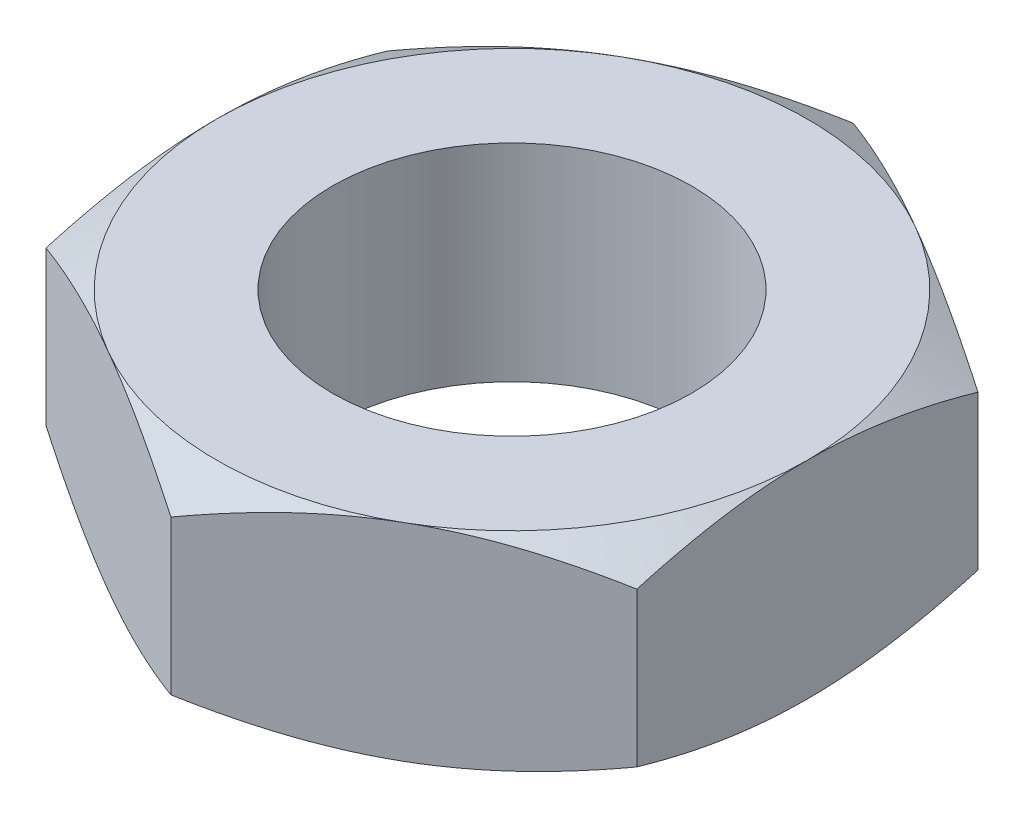
ISO-10303-21;
HEADER;
FILE_DESCRIPTION(('STEP AP214'),'2;1');
FILE_NAME('part.step','',(''),(''),'','','');
FILE_SCHEMA(('AUTOMOTIVE_DESIGN { 1 0 10303 214 1 1 1 1 }'));
ENDSEC;
DATA;
#1=APPLICATION_CONTEXT('core data for automotive mechanical design processes');
#2=APPLICATION_PROTOCOL_DEFINITION('international standard','automotive_design',2000,#1);
#3=PRODUCT_CONTEXT('',#1,'mechanical');
#4=PRODUCT('Part','Part','',(#3));
#5=PRODUCT_RELATED_PRODUCT_CATEGORY('part','',(#4));
#6=PRODUCT_DEFINITION_FORMATION('','',#4);
#7=PRODUCT_DEFINITION_CONTEXT('part definition',#1,'design');
#8=PRODUCT_DEFINITION('design','',#6,#7);
#9=PRODUCT_DEFINITION_SHAPE('','',#8);
#10=(LENGTH_UNIT() NAMED_UNIT(*) SI_UNIT(.MILLI.,.METRE.));
#11=(NAMED_UNIT(*) PLANE_ANGLE_UNIT() SI_UNIT($,.RADIAN.));
#12=(NAMED_UNIT(*) SI_UNIT($,.STERADIAN.) SOLID_ANGLE_UNIT());
#13=UNCERTAINTY_MEASURE_WITH_UNIT(LENGTH_MEASURE(1.E-05),#10,'distance_accuracy_value','');
#14=(GEOMETRIC_REPRESENTATION_CONTEXT(3) GLOBAL_UNCERTAINTY_ASSIGNED_CONTEXT((#13)) GLOBAL_UNIT_ASSIGNED_CONTEXT((#10,
#11,#12)) REPRESENTATION_CONTEXT('',''));
#15=CARTESIAN_POINT('',(0.,0.,0.));
#16=DIRECTION('',(0.,0.,1.));
#17=DIRECTION('',(1.,0.,0.));
#18=AXIS2_PLACEMENT_3D('',#15,#16,#17);
#19=CARTESIAN_POINT('',(-3.96875,1.3890625,-2.29135888084633));
#20=DIRECTION('',(0.,1.,0.));
#21=DIRECTION('',(0.,0.,1.));
#22=AXIS2_PLACEMENT_3D('',#19,#20,#21);
#23=PLANE('',#22);
#24=CARTESIAN_POINT('',(0.,1.3890625,0.));
#25=DIRECTION('',(0.,1.,0.));
#26=DIRECTION('',(0.,0.,1.));
#27=AXIS2_PLACEMENT_3D('',#24,#25,#26);
#28=CIRCLE('',#27,2.413);
#29=CARTESIAN_POINT('',(0.,1.3890625,2.413));
#30=VERTEX_POINT('',#29);
#31=EDGE_CURVE('E238',#30,#30,#28,.T.);
#32=ORIENTED_EDGE('',*,*,#31,.F.);
#33=EDGE_LOOP('',(#32));
#34=FACE_BOUND('',#33,.T.);
#35=CARTESIAN_POINT('',(0.,1.3890625,0.));
#36=DIRECTION('',(0.,1.,0.));
#37=DIRECTION('',(0.,0.,1.));
#38=AXIS2_PLACEMENT_3D('',#35,#36,#37);
#39=CIRCLE('',#38,3.96875);
#40=CARTESIAN_POINT('',(-1.984375,1.3890625,3.43703832126949));
#41=VERTEX_POINT('',#40);
#42=CARTESIAN_POINT('',(1.984375,1.3890625,3.43703832126949));
#43=VERTEX_POINT('',#42);
#44=EDGE_CURVE('E297',#41,#43,#39,.T.);
#45=ORIENTED_EDGE('',*,*,#44,.T.);
#46=CARTESIAN_POINT('',(3.96875,1.3890625,0.));
#47=VERTEX_POINT('',#46);
#48=EDGE_CURVE('E300',#43,#47,#39,.T.);
#49=ORIENTED_EDGE('',*,*,#48,.T.);
#50=CARTESIAN_POINT('',(1.984375,1.3890625,-3.43703832126949));
#51=VERTEX_POINT('',#50);
#52=EDGE_CURVE('E307',#47,#51,#39,.T.);
#53=ORIENTED_EDGE('',*,*,#52,.T.);
#54=CARTESIAN_POINT('',(-1.984375,1.3890625,-3.43703832126949));
#55=VERTEX_POINT('',#54);
#56=EDGE_CURVE('E311',#51,#55,#39,.T.);
#57=ORIENTED_EDGE('',*,*,#56,.T.);
#58=CARTESIAN_POINT('',(-3.96875,1.3890625,0.));
#59=VERTEX_POINT('',#58);
#60=EDGE_CURVE('E304',#55,#59,#39,.T.);
#61=ORIENTED_EDGE('',*,*,#60,.T.);
#62=EDGE_CURVE('E299',#59,#41,#39,.T.);
#63=ORIENTED_EDGE('',*,*,#62,.T.);
#64=EDGE_LOOP('',(#45,#49,#53,#57,#61,#63));
#65=FACE_BOUND('',#64,.T.);
#66=ADVANCED_FACE('F34',(#34,#65),#23,.T.);
#67=CARTESIAN_POINT('',(0.,1.3890625,-4.58271776169265));
#68=DIRECTION('',(0.5,0.,0.866025403784438));
#69=DIRECTION('',(0.866025403784439,0.,-0.5));
#70=AXIS2_PLACEMENT_3D('',#67,#68,#69);
#71=PLANE('',#70);
#72=DIRECTION('',(0.,-1.,0.));
#73=VECTOR('',#72,1.);
#74=CARTESIAN_POINT('',(0.,1.3890625,-4.58271776169265));
#75=LINE('',#74,#73);
#76=CARTESIAN_POINT('',(0.,1.034588047513,-4.58271776169265));
#77=VERTEX_POINT('',#76);
#78=CARTESIAN_POINT('',(0.,-1.034588047513,-4.58271776169265));
#79=VERTEX_POINT('',#78);
#80=EDGE_CURVE('E235',#77,#79,#75,.T.);
#81=ORIENTED_EDGE('',*,*,#80,.T.);
#82=CARTESIAN_POINT('',(0.00019999999999965,-1.03452137832671,-4.58283323174649));
#83=CARTESIAN_POINT('',(-0.174205902081157,-1.09267788164553,-4.48213993723168));
#84=CARTESIAN_POINT('',(-0.350117265982851,-1.14556901401833,-4.38057746392952));
#85=CARTESIAN_POINT('',(-0.704986056512738,-1.23789081645719,-4.17569387219009));
#86=CARTESIAN_POINT('',(-0.883949788458082,-1.27728882681341,-4.07236911337627));
#87=CARTESIAN_POINT('',(-1.23965934318176,-1.3386172964786,-3.86700010620323));
#88=CARTESIAN_POINT('',(-1.41635043707328,-1.36095593380879,-3.76498745558155));
#89=CARTESIAN_POINT('',(-1.7705639777928,-1.38762315750667,-3.56048217249653));
#90=CARTESIAN_POINT('',(-1.94808513722975,-1.39197382713073,-3.45799028330875));
#91=CARTESIAN_POINT('',(-2.27979074080338,-1.38292085025305,-3.26647996379381));
#92=CARTESIAN_POINT('',(-2.43402485076552,-1.37174001600782,-3.17743285888894));
#93=CARTESIAN_POINT('',(-2.74148824092522,-1.33630397944562,-2.99991878781428));
#94=CARTESIAN_POINT('',(-2.89471645773984,-1.31203667319011,-2.91145243558892));
#95=CARTESIAN_POINT('',(-3.20281373181353,-1.25137053864588,-2.73357239146588));
#96=CARTESIAN_POINT('',(-3.3576437962636,-1.21471455942136,-2.64418121207699));
#97=CARTESIAN_POINT('',(-3.66499472649982,-1.13151999862476,-2.46673206976942));
#98=CARTESIAN_POINT('',(-3.81751952962953,-1.08500096376704,-2.37867183362439));
#99=CARTESIAN_POINT('',(-3.96895,-1.03452137832671,-2.29124341079249));
#100=B_SPLINE_CURVE_WITH_KNOTS('',3,(#82,#83,#84,#85,#86,#87,#88,#89,#90,#91,#92,#93,#94,#95,
#96,#97,#98,#99),.UNSPECIFIED.,.F.,.F.,(4,2,2,2,2,2,2,2,4),(0.,0.629094460519773,
1.25970103886327,1.87470051579827,2.48894475282133,3.02377031984306,3.55909140824994,
4.1062865060967,4.65240713705191),.UNSPECIFIED.);
#101=CARTESIAN_POINT('',(-1.984375,-1.3890625,-3.43703832126949));
#102=VERTEX_POINT('',#101);
#103=EDGE_CURVE('E57',#79,#102,#100,.T.);
#104=ORIENTED_EDGE('',*,*,#103,.T.);
#105=CARTESIAN_POINT('',(-3.96875,-1.03458804751317,-2.2913588808466));
#106=VERTEX_POINT('',#105);
#107=EDGE_CURVE('E193',#102,#106,#100,.T.);
#108=ORIENTED_EDGE('',*,*,#107,.T.);
#109=DIRECTION('',(0.,-1.,0.));
#110=VECTOR('',#109,1.);
#111=CARTESIAN_POINT('',(-3.96875,1.3890625,-2.29135888084633));
#112=LINE('',#111,#110);
#113=CARTESIAN_POINT('',(-3.96875,1.03458804751317,-2.2913588808466));
#114=VERTEX_POINT('',#113);
#115=EDGE_CURVE('E223',#114,#106,#112,.T.);
#116=ORIENTED_EDGE('',*,*,#115,.F.);
#117=CARTESIAN_POINT('',(0.00019999999999965,1.03452137832671,-4.58283323174649));
#118=CARTESIAN_POINT('',(-0.174205902081157,1.09267788164553,-4.48213993723168));
#119=CARTESIAN_POINT('',(-0.350117265982851,1.14556901401833,-4.38057746392952));
#120=CARTESIAN_POINT('',(-0.704986056512738,1.23789081645719,-4.17569387219009));
#121=CARTESIAN_POINT('',(-0.883949788458082,1.27728882681341,-4.07236911337627));
#122=CARTESIAN_POINT('',(-1.23965934318176,1.3386172964786,-3.86700010620323));
#123=CARTESIAN_POINT('',(-1.41635043707328,1.36095593380879,-3.76498745558155));
#124=CARTESIAN_POINT('',(-1.7705639777928,1.38762315750667,-3.56048217249653));
#125=CARTESIAN_POINT('',(-1.94808513722975,1.39197382713073,-3.45799028330875));
#126=CARTESIAN_POINT('',(-2.27979074080338,1.38292085025305,-3.26647996379381));
#127=CARTESIAN_POINT('',(-2.43402485076552,1.37174001600782,-3.17743285888894));
#128=CARTESIAN_POINT('',(-2.74148824092522,1.33630397944562,-2.99991878781428));
#129=CARTESIAN_POINT('',(-2.89471645773984,1.31203667319011,-2.91145243558892));
#130=CARTESIAN_POINT('',(-3.20281373181353,1.25137053864588,-2.73357239146588));
#131=CARTESIAN_POINT('',(-3.3576437962636,1.21471455942136,-2.64418121207699));
#132=CARTESIAN_POINT('',(-3.66499472649982,1.13151999862476,-2.46673206976942));
#133=CARTESIAN_POINT('',(-3.81751952962953,1.08500096376704,-2.37867183362439));
#134=CARTESIAN_POINT('',(-3.96895,1.03452137832671,-2.29124341079249));
#135=B_SPLINE_CURVE_WITH_KNOTS('',3,(#117,#118,#119,#120,#121,#122,#123,#124,#125,#126,#127,
#128,#129,#130,#131,#132,#133,#134),.UNSPECIFIED.,.F.,.F.,(4,2,2,2,2,2,2,2,4),(0.,
0.629094460519773,1.25970103886327,1.87470051579827,2.48894475282133,3.02377031984306,
3.55909140824994,4.1062865060967,4.65240713705191),.UNSPECIFIED.);
#136=EDGE_CURVE('E245',#55,#114,#135,.T.);
#137=ORIENTED_EDGE('',*,*,#136,.F.);
#138=EDGE_CURVE('E242',#77,#55,#135,.T.);
#139=ORIENTED_EDGE('',*,*,#138,.F.);
#140=EDGE_LOOP('',(#81,#104,#108,#116,#137,#139));
#141=FACE_BOUND('',#140,.T.);
#142=ADVANCED_FACE('F36',(#141),#71,.F.);
#143=CARTESIAN_POINT('',(-3.96875,1.3890625,-2.29135888084633));
#144=DIRECTION('',(1.,0.,0.));
#145=DIRECTION('',(0.,0.,-1.));
#146=AXIS2_PLACEMENT_3D('',#143,#144,#145);
#147=PLANE('',#146);
#148=ORIENTED_EDGE('',*,*,#115,.T.);
#149=CARTESIAN_POINT('',(-3.96875,0.580270643707875,-6.22169695676345));
#150=CARTESIAN_POINT('',(-3.96875,0.495629554498546,-6.04776097042012));
#151=CARTESIAN_POINT('',(-3.96875,0.411781015228385,-5.87343276197247));
#152=CARTESIAN_POINT('',(-3.96875,0.246113557528974,-5.52378352626055));
#153=CARTESIAN_POINT('',(-3.96875,0.164294946503743,-5.34846235350417));
#154=CARTESIAN_POINT('',(-3.96875,0.00273455510915178,-4.99574743703183));
#155=CARTESIAN_POINT('',(-3.96875,-0.0769940637955183,-4.8183476443733));
#156=CARTESIAN_POINT('',(-3.96875,-0.233275940637596,-4.46216001234746));
#157=CARTESIAN_POINT('',(-3.96875,-0.3098293443539,-4.28337223715292));
#158=CARTESIAN_POINT('',(-3.96875,-0.461404283867797,-3.91814940793921));
#159=CARTESIAN_POINT('',(-3.96875,-0.536290207564717,-3.7316577704564));
#160=CARTESIAN_POINT('',(-3.96875,-0.680554504087907,-3.35651758495646));
#161=CARTESIAN_POINT('',(-3.96875,-0.74993226847017,-3.16786880128179));
#162=CARTESIAN_POINT('',(-3.96875,-0.881408126224332,-2.78844599514931));
#163=CARTESIAN_POINT('',(-3.96875,-0.943520384294776,-2.59767692965097));
#164=CARTESIAN_POINT('',(-3.96875,-1.05851662121305,-2.21340311120669));
#165=CARTESIAN_POINT('',(-3.96875,-1.11140343580595,-2.01989921874075));
#166=CARTESIAN_POINT('',(-3.96875,-1.20517636129246,-1.6311091012753));
#167=CARTESIAN_POINT('',(-3.96875,-1.24612852574059,-1.43583910195992));
#168=CARTESIAN_POINT('',(-3.96875,-1.31375702721554,-1.0428024899618));
#169=CARTESIAN_POINT('',(-3.96875,-1.34043487467902,-0.845036143697719));
#170=CARTESIAN_POINT('',(-3.96875,-1.3770403841221,-0.450605512338849));
#171=CARTESIAN_POINT('',(-3.96875,-1.38718865783126,-0.25396221985486));
#172=CARTESIAN_POINT('',(-3.96875,-1.39045976447106,0.139485992218314));
#173=CARTESIAN_POINT('',(-3.96875,-1.38358228756796,0.33629091468368));
#174=CARTESIAN_POINT('',(-3.96875,-1.35810261812635,0.668410754752708));
#175=CARTESIAN_POINT('',(-3.96875,-1.3437432404343,0.804072537555573));
#176=CARTESIAN_POINT('',(-3.96875,-1.30779247207964,1.0744408102038));
#177=CARTESIAN_POINT('',(-3.96875,-1.28620015652866,1.20914717562759));
#178=CARTESIAN_POINT('',(-3.96875,-1.21170483065242,1.61162887315064));
#179=CARTESIAN_POINT('',(-3.96875,-1.14909538893366,1.87762972847311));
#180=CARTESIAN_POINT('',(-3.96875,-1.04002741153514,2.27555191163833));
#181=CARTESIAN_POINT('',(-3.96875,-1.00061037701119,2.40952100703487));
#182=CARTESIAN_POINT('',(-3.96875,-0.917560151569727,2.67615857994853));
#183=CARTESIAN_POINT('',(-3.96875,-0.873926928994569,2.80882704769153));
#184=CARTESIAN_POINT('',(-3.96875,-0.783154734396829,3.07290448457615));
#185=CARTESIAN_POINT('',(-3.96875,-0.736016795290462,3.20431381202589));
#186=CARTESIAN_POINT('',(-3.96875,-0.638802011642294,3.46603416335526));
#187=CARTESIAN_POINT('',(-3.96875,-0.588725228974448,3.59634521029189));
#188=CARTESIAN_POINT('',(-3.96875,-0.452575047627681,3.94088412858893));
#189=CARTESIAN_POINT('',(-3.96875,-0.364374104411039,4.15427038484706));
#190=CARTESIAN_POINT('',(-3.96875,-0.18294698514972,4.57890352123334));
#191=CARTESIAN_POINT('',(-3.96875,-0.0897202959000224,4.79015018024977));
#192=CARTESIAN_POINT('',(-3.96875,0.100589836396977,5.21097578363183));
#193=CARTESIAN_POINT('',(-3.96875,0.197674518443244,5.42055416586364));
#194=CARTESIAN_POINT('',(-3.96875,0.394806200491001,5.83831597781125));
#195=CARTESIAN_POINT('',(-3.96875,0.494853286808513,6.04649936666374));
#196=CARTESIAN_POINT('',(-3.96875,0.697421654018019,6.46204015936939));
#197=CARTESIAN_POINT('',(-3.96875,0.799946395513732,6.66939587286292));
#198=CARTESIAN_POINT('',(-3.96875,1.00685664462163,7.08317779146199));
#199=CARTESIAN_POINT('',(-3.96875,1.11124217149255,7.2896039869195));
#200=CARTESIAN_POINT('',(-3.96875,1.42658702639339,7.90765670661576));
#201=CARTESIAN_POINT('',(-3.96875,1.63977745980658,8.31814439261519));
#202=CARTESIAN_POINT('',(-3.96875,2.04807122962612,9.09498840679135));
#203=CARTESIAN_POINT('',(-3.96875,2.24278532373391,9.46155029736983));
#204=CARTESIAN_POINT('',(-3.96875,2.63459143839332,10.1934273187956));
#205=CARTESIAN_POINT('',(-3.96875,2.83168359443524,10.5587423770687));
#206=CARTESIAN_POINT('',(-3.96875,3.22699755433617,11.2872403110954));
#207=CARTESIAN_POINT('',(-3.96875,3.42521369250251,11.6504262661362));
#208=CARTESIAN_POINT('',(-3.96875,3.82300419769018,12.3760186060547));
#209=CARTESIAN_POINT('',(-3.96875,4.02257846210827,12.7384250471593));
#210=CARTESIAN_POINT('',(-3.96875,4.22264849263489,13.1005558551109));
#211=B_SPLINE_CURVE_WITH_KNOTS('',3,(#149,#150,#151,#152,#153,#154,#155,#156,#157,#158,#159,
#160,#161,#162,#163,#164,#165,#166,#167,#168,#169,#170,#171,#172,#173,#174,#175,#176,#177,#178,
#179,#180,#181,#182,#183,#184,#185,#186,#187,#188,#189,#190,#191,#192,#193,#194,#195,#196,#197,
#198,#199,#200,#201,#202,#203,#204,#205,#206,#207,#208,#209,#210),.UNSPECIFIED.,.F.,.F.,(4,2,2,
2,2,2,2,2,2,2,2,2,2,2,2,2,2,2,2,2,2,2,2,2,2,2,2,2,2,2,4),(0.,0.580317532576746,1.16072241618541,
1.74417501419442,2.32760079530033,2.93042926439164,3.53332423092783,4.13502349111168,
4.73653747196744,5.33465617674795,5.93271157908309,6.52271762195251,7.11273440180051,
7.52179616412226,7.93091025386496,8.74954934292227,9.16845446095107,9.58736272461321,
10.0061480125919,10.4249244866913,11.1175183219819,11.8101830160883,12.5030719870989,
13.1959811668256,13.8899215612347,14.5838691419566,15.9714733438239,17.2166675132063,
18.4619329658364,19.7031966118937,20.9443675020377),.UNSPECIFIED.);
#212=CARTESIAN_POINT('',(-3.96875,-1.3890625,0.));
#213=VERTEX_POINT('',#212);
#214=EDGE_CURVE('E278',#106,#213,#211,.T.);
#215=ORIENTED_EDGE('',*,*,#214,.T.);
#216=CARTESIAN_POINT('',(-3.96875,-1.034588047513,2.29135888084633));
#217=VERTEX_POINT('',#216);
#218=EDGE_CURVE('E272',#213,#217,#211,.T.);
#219=ORIENTED_EDGE('',*,*,#218,.T.);
#220=DIRECTION('',(0.,-1.,0.));
#221=VECTOR('',#220,1.);
#222=CARTESIAN_POINT('',(-3.96875,1.3890625,2.29135888084633));
#223=LINE('',#222,#221);
#224=CARTESIAN_POINT('',(-3.96875,1.034588047513,2.29135888084633));
#225=VERTEX_POINT('',#224);
#226=EDGE_CURVE('E226',#225,#217,#223,.T.);
#227=ORIENTED_EDGE('',*,*,#226,.F.);
#228=CARTESIAN_POINT('',(-3.96875,-0.580270643707875,-6.22169695676345));
#229=CARTESIAN_POINT('',(-3.96875,-0.495629554498546,-6.04776097042012));
#230=CARTESIAN_POINT('',(-3.96875,-0.411781015228385,-5.87343276197247));
#231=CARTESIAN_POINT('',(-3.96875,-0.246113557528974,-5.52378352626055));
#232=CARTESIAN_POINT('',(-3.96875,-0.164294946503743,-5.34846235350417));
#233=CARTESIAN_POINT('',(-3.96875,-0.00273455510915178,-4.99574743703183));
#234=CARTESIAN_POINT('',(-3.96875,0.0769940637955183,-4.8183476443733));
#235=CARTESIAN_POINT('',(-3.96875,0.233275940637596,-4.46216001234746));
#236=CARTESIAN_POINT('',(-3.96875,0.3098293443539,-4.28337223715292));
#237=CARTESIAN_POINT('',(-3.96875,0.461404283867797,-3.91814940793921));
#238=CARTESIAN_POINT('',(-3.96875,0.536290207564717,-3.7316577704564));
#239=CARTESIAN_POINT('',(-3.96875,0.680554504087907,-3.35651758495646));
#240=CARTESIAN_POINT('',(-3.96875,0.74993226847017,-3.16786880128179));
#241=CARTESIAN_POINT('',(-3.96875,0.881408126224332,-2.78844599514931));
#242=CARTESIAN_POINT('',(-3.96875,0.943520384294776,-2.59767692965097));
#243=CARTESIAN_POINT('',(-3.96875,1.05851662121305,-2.21340311120669));
#244=CARTESIAN_POINT('',(-3.96875,1.11140343580595,-2.01989921874075));
#245=CARTESIAN_POINT('',(-3.96875,1.20517636129246,-1.6311091012753));
#246=CARTESIAN_POINT('',(-3.96875,1.24612852574059,-1.43583910195992));
#247=CARTESIAN_POINT('',(-3.96875,1.31375702721554,-1.0428024899618));
#248=CARTESIAN_POINT('',(-3.96875,1.34043487467902,-0.845036143697719));
#249=CARTESIAN_POINT('',(-3.96875,1.3770403841221,-0.450605512338849));
#250=CARTESIAN_POINT('',(-3.96875,1.38718865783126,-0.25396221985486));
#251=CARTESIAN_POINT('',(-3.96875,1.39045976447106,0.139485992218314));
#252=CARTESIAN_POINT('',(-3.96875,1.38358228756796,0.33629091468368));
#253=CARTESIAN_POINT('',(-3.96875,1.35810261812635,0.668410754752708));
#254=CARTESIAN_POINT('',(-3.96875,1.3437432404343,0.804072537555573));
#255=CARTESIAN_POINT('',(-3.96875,1.30779247207964,1.0744408102038));
#256=CARTESIAN_POINT('',(-3.96875,1.28620015652866,1.20914717562759));
#257=CARTESIAN_POINT('',(-3.96875,1.21170483065242,1.61162887315064));
#258=CARTESIAN_POINT('',(-3.96875,1.14909538893366,1.87762972847311));
#259=CARTESIAN_POINT('',(-3.96875,1.04002741153514,2.27555191163833));
#260=CARTESIAN_POINT('',(-3.96875,1.00061037701119,2.40952100703487));
#261=CARTESIAN_POINT('',(-3.96875,0.917560151569727,2.67615857994853));
#262=CARTESIAN_POINT('',(-3.96875,0.873926928994569,2.80882704769153));
#263=CARTESIAN_POINT('',(-3.96875,0.783154734396829,3.07290448457615));
#264=CARTESIAN_POINT('',(-3.96875,0.736016795290462,3.20431381202589));
#265=CARTESIAN_POINT('',(-3.96875,0.638802011642294,3.46603416335526));
#266=CARTESIAN_POINT('',(-3.96875,0.588725228974448,3.59634521029189));
#267=CARTESIAN_POINT('',(-3.96875,0.452575047627681,3.94088412858893));
#268=CARTESIAN_POINT('',(-3.96875,0.364374104411039,4.15427038484706));
#269=CARTESIAN_POINT('',(-3.96875,0.18294698514972,4.57890352123334));
#270=CARTESIAN_POINT('',(-3.96875,0.0897202959000224,4.79015018024977));
#271=CARTESIAN_POINT('',(-3.96875,-0.100589836396977,5.21097578363183));
#272=CARTESIAN_POINT('',(-3.96875,-0.197674518443244,5.42055416586364));
#273=CARTESIAN_POINT('',(-3.96875,-0.394806200491001,5.83831597781125));
#274=CARTESIAN_POINT('',(-3.96875,-0.494853286808513,6.04649936666374));
#275=CARTESIAN_POINT('',(-3.96875,-0.697421654018019,6.46204015936939));
#276=CARTESIAN_POINT('',(-3.96875,-0.799946395513732,6.66939587286292));
#277=CARTESIAN_POINT('',(-3.96875,-1.00685664462163,7.08317779146199));
#278=CARTESIAN_POINT('',(-3.96875,-1.11124217149255,7.2896039869195));
#279=CARTESIAN_POINT('',(-3.96875,-1.42658702639339,7.90765670661576));
#280=CARTESIAN_POINT('',(-3.96875,-1.63977745980658,8.31814439261519));
#281=CARTESIAN_POINT('',(-3.96875,-2.04807122962612,9.09498840679135));
#282=CARTESIAN_POINT('',(-3.96875,-2.24278532373391,9.46155029736983));
#283=CARTESIAN_POINT('',(-3.96875,-2.63459143839332,10.1934273187956));
#284=CARTESIAN_POINT('',(-3.96875,-2.83168359443524,10.5587423770687));
#285=CARTESIAN_POINT('',(-3.96875,-3.22699755433617,11.2872403110954));
#286=CARTESIAN_POINT('',(-3.96875,-3.42521369250251,11.6504262661362));
#287=CARTESIAN_POINT('',(-3.96875,-3.82300419769018,12.3760186060547));
#288=CARTESIAN_POINT('',(-3.96875,-4.02257846210827,12.7384250471593));
#289=CARTESIAN_POINT('',(-3.96875,-4.22264849263489,13.1005558551109));
#290=B_SPLINE_CURVE_WITH_KNOTS('',3,(#228,#229,#230,#231,#232,#233,#234,#235,#236,#237,#238,
#239,#240,#241,#242,#243,#244,#245,#246,#247,#248,#249,#250,#251,#252,#253,#254,#255,#256,#257,
#258,#259,#260,#261,#262,#263,#264,#265,#266,#267,#268,#269,#270,#271,#272,#273,#274,#275,#276,
#277,#278,#279,#280,#281,#282,#283,#284,#285,#286,#287,#288,#289),.UNSPECIFIED.,.F.,.F.,(4,2,2,
2,2,2,2,2,2,2,2,2,2,2,2,2,2,2,2,2,2,2,2,2,2,2,2,2,2,2,4),(0.,0.580317532576746,1.16072241618541,
1.74417501419442,2.32760079530033,2.93042926439164,3.53332423092783,4.13502349111168,
4.73653747196744,5.33465617674795,5.93271157908309,6.52271762195251,7.11273440180051,
7.52179616412226,7.93091025386496,8.74954934292227,9.16845446095107,9.58736272461321,
10.0061480125919,10.4249244866913,11.1175183219819,11.8101830160883,12.5030719870989,
13.1959811668256,13.8899215612347,14.5838691419566,15.9714733438239,17.2166675132063,
18.4619329658364,19.7031966118937,20.9443675020377),.UNSPECIFIED.);
#291=EDGE_CURVE('E252',#59,#225,#290,.T.);
#292=ORIENTED_EDGE('',*,*,#291,.F.);
#293=EDGE_CURVE('E251',#114,#59,#290,.T.);
#294=ORIENTED_EDGE('',*,*,#293,.F.);
#295=EDGE_LOOP('',(#148,#215,#219,#227,#292,#294));
#296=FACE_BOUND('',#295,.T.);
#297=ADVANCED_FACE('F265',(#296),#147,.F.);
#298=CARTESIAN_POINT('',(-3.96875,1.3890625,2.29135888084633));
#299=DIRECTION('',(0.5,0.,-0.866025403784438));
#300=DIRECTION('',(-0.866025403784439,0.,-0.5));
#301=AXIS2_PLACEMENT_3D('',#298,#299,#300);
#302=PLANE('',#301);
#303=ORIENTED_EDGE('',*,*,#226,.T.);
#304=CARTESIAN_POINT('',(-3.96895,-1.03452137832671,2.29124341079249));
#305=CARTESIAN_POINT('',(-3.79454409791884,-1.09267788164553,2.3919367053073));
#306=CARTESIAN_POINT('',(-3.61863273401715,-1.14556901401833,2.49349917860946));
#307=CARTESIAN_POINT('',(-3.26376394348726,-1.23789081645719,2.69838277034889));
#308=CARTESIAN_POINT('',(-3.08480021154192,-1.27728882681341,2.80170752916271));
#309=CARTESIAN_POINT('',(-2.72909065681824,-1.3386172964786,3.00707653633575));
#310=CARTESIAN_POINT('',(-2.55239956292672,-1.36095593380879,3.10908918695743));
#311=CARTESIAN_POINT('',(-2.1981860222072,-1.38762315750667,3.31359447004245));
#312=CARTESIAN_POINT('',(-2.02066486277025,-1.39197382713073,3.41608635923023));
#313=CARTESIAN_POINT('',(-1.68895925919662,-1.38292085025305,3.60759667874517));
#314=CARTESIAN_POINT('',(-1.53472514923448,-1.37174001600782,3.69664378365004));
#315=CARTESIAN_POINT('',(-1.22726175907477,-1.33630397944562,3.8741578547247));
#316=CARTESIAN_POINT('',(-1.07403354226016,-1.31203667319011,3.96262420695006));
#317=CARTESIAN_POINT('',(-0.765936268186465,-1.25137053864588,4.1405042510731));
#318=CARTESIAN_POINT('',(-0.611106203736397,-1.21471455942136,4.229895430462));
#319=CARTESIAN_POINT('',(-0.303755273500179,-1.13151999862476,4.40734457276956));
#320=CARTESIAN_POINT('',(-0.151230470370471,-1.08500096376703,4.49540480891459));
#321=CARTESIAN_POINT('',(0.000200000000000126,-1.03452137832671,4.58283323174649));
#322=B_SPLINE_CURVE_WITH_KNOTS('',3,(#304,#305,#306,#307,#308,#309,#310,#311,#312,#313,#314,
#315,#316,#317,#318,#319,#320,#321),.UNSPECIFIED.,.F.,.F.,(4,2,2,2,2,2,2,2,4),(0.,
0.629094460519771,1.25970103886327,1.87470051579826,2.48894475282133,3.02377031984306,
3.55909140824994,4.1062865060967,4.65240713705191),.UNSPECIFIED.);
#323=CARTESIAN_POINT('',(-1.984375,-1.3890625,3.43703832126949));
#324=VERTEX_POINT('',#323);
#325=EDGE_CURVE('E158',#217,#324,#322,.T.);
#326=ORIENTED_EDGE('',*,*,#325,.T.);
#327=CARTESIAN_POINT('',(0.,-1.034588047513,4.58271776169265));
#328=VERTEX_POINT('',#327);
#329=EDGE_CURVE('E142',#324,#328,#322,.T.);
#330=ORIENTED_EDGE('',*,*,#329,.T.);
#331=DIRECTION('',(0.,-1.,0.));
#332=VECTOR('',#331,1.);
#333=CARTESIAN_POINT('',(0.,1.3890625,4.58271776169265));
#334=LINE('',#333,#332);
#335=CARTESIAN_POINT('',(0.,1.034588047513,4.58271776169265));
#336=VERTEX_POINT('',#335);
#337=EDGE_CURVE('E157',#336,#328,#334,.T.);
#338=ORIENTED_EDGE('',*,*,#337,.F.);
#339=CARTESIAN_POINT('',(-3.96895,1.03452137832671,2.29124341079249));
#340=CARTESIAN_POINT('',(-3.79454409791884,1.09267788164553,2.3919367053073));
#341=CARTESIAN_POINT('',(-3.61863273401715,1.14556901401833,2.49349917860946));
#342=CARTESIAN_POINT('',(-3.26376394348726,1.23789081645719,2.69838277034889));
#343=CARTESIAN_POINT('',(-3.08480021154192,1.27728882681341,2.80170752916271));
#344=CARTESIAN_POINT('',(-2.72909065681824,1.3386172964786,3.00707653633575));
#345=CARTESIAN_POINT('',(-2.55239956292672,1.36095593380879,3.10908918695743));
#346=CARTESIAN_POINT('',(-2.1981860222072,1.38762315750667,3.31359447004245));
#347=CARTESIAN_POINT('',(-2.02066486277025,1.39197382713073,3.41608635923023));
#348=CARTESIAN_POINT('',(-1.68895925919662,1.38292085025305,3.60759667874517));
#349=CARTESIAN_POINT('',(-1.53472514923448,1.37174001600782,3.69664378365004));
#350=CARTESIAN_POINT('',(-1.22726175907477,1.33630397944562,3.8741578547247));
#351=CARTESIAN_POINT('',(-1.07403354226016,1.31203667319011,3.96262420695006));
#352=CARTESIAN_POINT('',(-0.765936268186465,1.25137053864588,4.1405042510731));
#353=CARTESIAN_POINT('',(-0.611106203736397,1.21471455942136,4.229895430462));
#354=CARTESIAN_POINT('',(-0.303755273500179,1.13151999862476,4.40734457276956));
#355=CARTESIAN_POINT('',(-0.151230470370471,1.08500096376703,4.49540480891459));
#356=CARTESIAN_POINT('',(0.000200000000000126,1.03452137832671,4.58283323174649));
#357=B_SPLINE_CURVE_WITH_KNOTS('',3,(#339,#340,#341,#342,#343,#344,#345,#346,#347,#348,#349,
#350,#351,#352,#353,#354,#355,#356),.UNSPECIFIED.,.F.,.F.,(4,2,2,2,2,2,2,2,4),(0.,
0.629094460519771,1.25970103886327,1.87470051579826,2.48894475282133,3.02377031984306,
3.55909140824994,4.1062865060967,4.65240713705191),.UNSPECIFIED.);
#358=EDGE_CURVE('E259',#41,#336,#357,.T.);
#359=ORIENTED_EDGE('',*,*,#358,.F.);
#360=EDGE_CURVE('E258',#225,#41,#357,.T.);
#361=ORIENTED_EDGE('',*,*,#360,.F.);
#362=EDGE_LOOP('',(#303,#326,#330,#338,#359,#361));
#363=FACE_BOUND('',#362,.T.);
#364=ADVANCED_FACE('F268',(#363),#302,.F.);
#365=CARTESIAN_POINT('',(0.,1.3890625,4.58271776169265));
#366=DIRECTION('',(-0.5,0.,-0.866025403784438));
#367=DIRECTION('',(-0.866025403784439,0.,0.5));
#368=AXIS2_PLACEMENT_3D('',#365,#366,#367);
#369=PLANE('',#368);
#370=ORIENTED_EDGE('',*,*,#337,.T.);
#371=CARTESIAN_POINT('',(-0.000200000000000108,-1.03452137832671,4.58283323174649));
#372=CARTESIAN_POINT('',(0.174205902081156,-1.09267788164553,4.48213993723168));
#373=CARTESIAN_POINT('',(0.35011726598285,-1.14556901401833,4.38057746392952));
#374=CARTESIAN_POINT('',(0.704986056512737,-1.23789081645719,4.17569387219009));
#375=CARTESIAN_POINT('',(0.883949788458081,-1.27728882681341,4.07236911337627));
#376=CARTESIAN_POINT('',(1.23965934318176,-1.3386172964786,3.86700010620323));
#377=CARTESIAN_POINT('',(1.41635043707328,-1.36095593380879,3.76498745558155));
#378=CARTESIAN_POINT('',(1.7705639777928,-1.38762315750667,3.56048217249653));
#379=CARTESIAN_POINT('',(1.94808513722975,-1.39197382713073,3.45799028330875));
#380=CARTESIAN_POINT('',(2.27979074080338,-1.38292085025305,3.26647996379381));
#381=CARTESIAN_POINT('',(2.43402485076552,-1.37174001600782,3.17743285888894));
#382=CARTESIAN_POINT('',(2.74148824092522,-1.33630397944562,2.99991878781428));
#383=CARTESIAN_POINT('',(2.89471645773984,-1.31203667319011,2.91145243558892));
#384=CARTESIAN_POINT('',(3.20281373181353,-1.25137053864589,2.73357239146588));
#385=CARTESIAN_POINT('',(3.3576437962636,-1.21471455942136,2.64418121207699));
#386=CARTESIAN_POINT('',(3.66499472649982,-1.13151999862476,2.46673206976942));
#387=CARTESIAN_POINT('',(3.81751952962953,-1.08500096376704,2.37867183362439));
#388=CARTESIAN_POINT('',(3.96895,-1.03452137832671,2.29124341079249));
#389=B_SPLINE_CURVE_WITH_KNOTS('',3,(#371,#372,#373,#374,#375,#376,#377,#378,#379,#380,#381,
#382,#383,#384,#385,#386,#387,#388),.UNSPECIFIED.,.F.,.F.,(4,2,2,2,2,2,2,2,4),(0.,
0.629094460519772,1.25970103886327,1.87470051579826,2.48894475282133,3.02377031984306,
3.55909140824994,4.1062865060967,4.65240713705191),.UNSPECIFIED.);
#390=CARTESIAN_POINT('',(1.984375,-1.3890625,3.43703832126949));
#391=VERTEX_POINT('',#390);
#392=EDGE_CURVE('E136',#328,#391,#389,.T.);
#393=ORIENTED_EDGE('',*,*,#392,.T.);
#394=CARTESIAN_POINT('',(3.96875,-1.034588047513,2.29135888084633));
#395=VERTEX_POINT('',#394);
#396=EDGE_CURVE('E124',#391,#395,#389,.T.);
#397=ORIENTED_EDGE('',*,*,#396,.T.);
#398=DIRECTION('',(0.,-1.,0.));
#399=VECTOR('',#398,1.);
#400=CARTESIAN_POINT('',(3.96875,1.3890625,2.29135888084633));
#401=LINE('',#400,#399);
#402=CARTESIAN_POINT('',(3.96875,1.034588047513,2.29135888084633));
#403=VERTEX_POINT('',#402);
#404=EDGE_CURVE('E230',#403,#395,#401,.T.);
#405=ORIENTED_EDGE('',*,*,#404,.F.);
#406=CARTESIAN_POINT('',(-0.000200000000000108,1.03452137832671,4.58283323174649));
#407=CARTESIAN_POINT('',(0.174205902081156,1.09267788164553,4.48213993723168));
#408=CARTESIAN_POINT('',(0.35011726598285,1.14556901401833,4.38057746392952));
#409=CARTESIAN_POINT('',(0.704986056512737,1.23789081645719,4.17569387219009));
#410=CARTESIAN_POINT('',(0.883949788458081,1.27728882681341,4.07236911337627));
#411=CARTESIAN_POINT('',(1.23965934318176,1.3386172964786,3.86700010620323));
#412=CARTESIAN_POINT('',(1.41635043707328,1.36095593380879,3.76498745558155));
#413=CARTESIAN_POINT('',(1.7705639777928,1.38762315750667,3.56048217249653));
#414=CARTESIAN_POINT('',(1.94808513722975,1.39197382713073,3.45799028330875));
#415=CARTESIAN_POINT('',(2.27979074080338,1.38292085025305,3.26647996379381));
#416=CARTESIAN_POINT('',(2.43402485076552,1.37174001600782,3.17743285888894));
#417=CARTESIAN_POINT('',(2.74148824092522,1.33630397944562,2.99991878781428));
#418=CARTESIAN_POINT('',(2.89471645773984,1.31203667319011,2.91145243558892));
#419=CARTESIAN_POINT('',(3.20281373181353,1.25137053864589,2.73357239146588));
#420=CARTESIAN_POINT('',(3.3576437962636,1.21471455942136,2.64418121207699));
#421=CARTESIAN_POINT('',(3.66499472649982,1.13151999862476,2.46673206976942));
#422=CARTESIAN_POINT('',(3.81751952962953,1.08500096376704,2.37867183362439));
#423=CARTESIAN_POINT('',(3.96895,1.03452137832671,2.29124341079249));
#424=B_SPLINE_CURVE_WITH_KNOTS('',3,(#406,#407,#408,#409,#410,#411,#412,#413,#414,#415,#416,
#417,#418,#419,#420,#421,#422,#423),.UNSPECIFIED.,.F.,.F.,(4,2,2,2,2,2,2,2,4),(0.,
0.629094460519772,1.25970103886327,1.87470051579826,2.48894475282133,3.02377031984306,
3.55909140824994,4.1062865060967,4.65240713705191),.UNSPECIFIED.);
#425=EDGE_CURVE('E329',#43,#403,#424,.T.);
#426=ORIENTED_EDGE('',*,*,#425,.F.);
#427=EDGE_CURVE('E331',#336,#43,#424,.T.);
#428=ORIENTED_EDGE('',*,*,#427,.F.);
#429=EDGE_LOOP('',(#370,#393,#397,#405,#426,#428));
#430=FACE_BOUND('',#429,.T.);
#431=ADVANCED_FACE('F154',(#430),#369,.F.);
#432=CARTESIAN_POINT('',(3.96875,1.3890625,2.29135888084633));
#433=DIRECTION('',(-1.,0.,0.));
#434=DIRECTION('',(0.,0.,1.));
#435=AXIS2_PLACEMENT_3D('',#432,#433,#434);
#436=PLANE('',#435);
#437=ORIENTED_EDGE('',*,*,#404,.T.);
#438=CARTESIAN_POINT('',(3.96875,0.580270644592316,-6.22169695858048));
#439=CARTESIAN_POINT('',(3.96875,0.495629555346083,-6.047760972176));
#440=CARTESIAN_POINT('',(3.96875,0.411781016039039,-5.87343276366715));
#441=CARTESIAN_POINT('',(3.96875,0.246113558266038,-5.52378352783265));
#442=CARTESIAN_POINT('',(3.96875,0.164294947204102,-5.34846235501489));
#443=CARTESIAN_POINT('',(3.96875,0.00273455573607695,-4.99574743841885));
#444=CARTESIAN_POINT('',(3.96875,-0.0769940632053148,-4.81834764569799));
#445=CARTESIAN_POINT('',(3.96875,-0.233275940120227,-4.46216001354709));
#446=CARTESIAN_POINT('',(3.96875,-0.309829343872644,-4.2833722382898));
#447=CARTESIAN_POINT('',(3.96875,-0.461404283459805,-3.91814940894576));
#448=CARTESIAN_POINT('',(3.96875,-0.536290207193792,-3.73165777139531));
#449=CARTESIAN_POINT('',(3.96875,-0.680554503789142,-3.356517585759));
#450=CARTESIAN_POINT('',(3.96875,-0.749932268206498,-3.1678688020156));
#451=CARTESIAN_POINT('',(3.96875,-0.881408126027497,-2.7884459957444));
#452=CARTESIAN_POINT('',(3.96875,-0.943520384129694,-2.59767693017607));
#453=CARTESIAN_POINT('',(3.96875,-1.0585166211063,-2.2134031115899));
#454=CARTESIAN_POINT('',(3.96875,-1.1114034357258,-2.01989921905207));
#455=CARTESIAN_POINT('',(3.96875,-1.20517636126597,-1.63110910140599));
#456=CARTESIAN_POINT('',(3.96875,-1.24612852573913,-1.43583910198137));
#457=CARTESIAN_POINT('',(3.96875,-1.31375702724767,-1.04280248976214));
#458=CARTESIAN_POINT('',(3.96875,-1.34043487471972,-0.84503614338618));
#459=CARTESIAN_POINT('',(3.96875,-1.37704038415999,-0.450605511805401));
#460=CARTESIAN_POINT('',(3.96875,-1.38718865785815,-0.253962219211404));
#461=CARTESIAN_POINT('',(3.96875,-1.3904597644567,0.139485993080117));
#462=CARTESIAN_POINT('',(3.96875,-1.38358228752336,0.336290915653822));
#463=CARTESIAN_POINT('',(3.96875,-1.35810261802072,0.668410755858784));
#464=CARTESIAN_POINT('',(3.96875,-1.34374324030448,0.804072538690473));
#465=CARTESIAN_POINT('',(3.96875,-1.30779247190017,1.07444081139505));
#466=CARTESIAN_POINT('',(3.96875,-1.28620015632371,1.20914717684638));
#467=CARTESIAN_POINT('',(3.96875,-1.21170483037051,1.61162887445052));
#468=CARTESIAN_POINT('',(3.96875,-1.14909538859978,1.87762972982491));
#469=CARTESIAN_POINT('',(3.96875,-1.04002741112456,2.27555191306781));
#470=CARTESIAN_POINT('',(3.96875,-1.00061037657487,2.40952100849079));
#471=CARTESIAN_POINT('',(3.96875,-0.917560151082714,2.67615858145704));
#472=CARTESIAN_POINT('',(3.96875,-0.873926928482603,2.80882704922619));
#473=CARTESIAN_POINT('',(3.96875,-0.783154733835851,3.07290448616292));
#474=CARTESIAN_POINT('',(3.96875,-0.736016794705428,3.20431381363862));
#475=CARTESIAN_POINT('',(3.96875,-0.638802011009983,3.4660341650199));
#476=CARTESIAN_POINT('',(3.96875,-0.588725228318917,3.59634521198249));
#477=CARTESIAN_POINT('',(3.96875,-0.452575046932804,3.94088413029471));
#478=CARTESIAN_POINT('',(3.96875,-0.364374103702386,4.1542703865428));
#479=CARTESIAN_POINT('',(3.96875,-0.182946984417413,4.57890352291026));
#480=CARTESIAN_POINT('',(3.96875,-0.0897202951578391,4.79015018191792));
#481=CARTESIAN_POINT('',(3.96875,0.10058983715607,5.21097578528339));
#482=CARTESIAN_POINT('',(3.96875,0.197674519209366,5.42055416750738));
#483=CARTESIAN_POINT('',(3.96875,0.394806201269148,5.83831597944015));
#484=CARTESIAN_POINT('',(3.96875,0.494853287591656,6.04649936828564));
#485=CARTESIAN_POINT('',(3.96875,0.697421654809467,6.46204016097752));
#486=CARTESIAN_POINT('',(3.96875,0.799946396308484,6.66939587446428));
#487=CARTESIAN_POINT('',(3.96875,1.00685664542186,7.08317779305034));
#488=CARTESIAN_POINT('',(3.96875,1.11124217229495,7.28960398850158));
#489=CARTESIAN_POINT('',(3.96875,1.42658702720112,7.90765670817981));
#490=CARTESIAN_POINT('',(3.96875,1.6397774606162,8.31814439416806));
#491=CARTESIAN_POINT('',(3.96875,2.0480712304422,9.09498840833302));
#492=CARTESIAN_POINT('',(3.96875,2.24278532455485,9.46155029891136));
#493=CARTESIAN_POINT('',(3.96875,2.63459143922298,10.1934273203373));
#494=CARTESIAN_POINT('',(3.96875,2.83168359526876,10.5587423786107));
#495=CARTESIAN_POINT('',(3.96875,3.22699755517756,11.2872403126399));
#496=CARTESIAN_POINT('',(3.96875,3.42521369334793,11.6504262676829));
#497=CARTESIAN_POINT('',(3.96875,3.8230041985432,12.3760186076061));
#498=CARTESIAN_POINT('',(3.96875,4.02257846296487,12.7384250487132));
#499=CARTESIAN_POINT('',(3.96875,4.22264849349491,13.1005558566674));
#500=B_SPLINE_CURVE_WITH_KNOTS('',3,(#438,#439,#440,#441,#442,#443,#444,#445,#446,#447,#448,
#449,#450,#451,#452,#453,#454,#455,#456,#457,#458,#459,#460,#461,#462,#463,#464,#465,#466,#467,
#468,#469,#470,#471,#472,#473,#474,#475,#476,#477,#478,#479,#480,#481,#482,#483,#484,#485,#486,
#487,#488,#489,#490,#491,#492,#493,#494,#495,#496,#497,#498,#499),.UNSPECIFIED.,.F.,.F.,(4,2,2,
2,2,2,2,2,2,2,2,2,2,2,2,2,2,2,2,2,2,2,2,2,2,2,2,2,2,2,4),(0.,0.580317532790153,1.16072241661226,
1.74417501483696,2.32760079615855,2.93042926547958,3.53332423224556,4.13502349265846,
4.73653747374307,5.334656178859,5.93271158152908,6.52271762472512,7.1127344048999,
7.52179616731526,7.93091025715158,8.74954934639652,9.16845446452328,9.58736272828336,
10.0061480163598,10.4249244905568,11.1175183258355,11.8101830199298,12.503071990928,
13.1959811706424,13.8899215650377,14.5838691457458,15.971473347586,17.2166675169748,
18.4619329696112,19.7031966156801,20.9443675058358),.UNSPECIFIED.);
#501=CARTESIAN_POINT('',(3.96875,-1.3890625,0.));
#502=VERTEX_POINT('',#501);
#503=EDGE_CURVE('E131',#395,#502,#500,.F.);
#504=ORIENTED_EDGE('',*,*,#503,.T.);
#505=CARTESIAN_POINT('',(3.96875,-1.034588047513,-2.29135888084633));
#506=VERTEX_POINT('',#505);
#507=EDGE_CURVE('E167',#502,#506,#500,.F.);
#508=ORIENTED_EDGE('',*,*,#507,.T.);
#509=DIRECTION('',(0.,-1.,0.));
#510=VECTOR('',#509,1.);
#511=CARTESIAN_POINT('',(3.96875,1.3890625,-2.29135888084633));
#512=LINE('',#511,#510);
#513=CARTESIAN_POINT('',(3.96875,1.034588047513,-2.29135888084633));
#514=VERTEX_POINT('',#513);
#515=EDGE_CURVE('E232',#514,#506,#512,.T.);
#516=ORIENTED_EDGE('',*,*,#515,.F.);
#517=CARTESIAN_POINT('',(3.96875,-0.580270644592316,-6.22169695858048));
#518=CARTESIAN_POINT('',(3.96875,-0.495629555346083,-6.047760972176));
#519=CARTESIAN_POINT('',(3.96875,-0.411781016039039,-5.87343276366715));
#520=CARTESIAN_POINT('',(3.96875,-0.246113558266038,-5.52378352783265));
#521=CARTESIAN_POINT('',(3.96875,-0.164294947204102,-5.34846235501489));
#522=CARTESIAN_POINT('',(3.96875,-0.00273455573607695,-4.99574743841885));
#523=CARTESIAN_POINT('',(3.96875,0.0769940632053148,-4.81834764569799));
#524=CARTESIAN_POINT('',(3.96875,0.233275940120227,-4.46216001354709));
#525=CARTESIAN_POINT('',(3.96875,0.309829343872644,-4.2833722382898));
#526=CARTESIAN_POINT('',(3.96875,0.461404283459805,-3.91814940894576));
#527=CARTESIAN_POINT('',(3.96875,0.536290207193792,-3.73165777139531));
#528=CARTESIAN_POINT('',(3.96875,0.680554503789142,-3.356517585759));
#529=CARTESIAN_POINT('',(3.96875,0.749932268206498,-3.1678688020156));
#530=CARTESIAN_POINT('',(3.96875,0.881408126027497,-2.7884459957444));
#531=CARTESIAN_POINT('',(3.96875,0.943520384129694,-2.59767693017607));
#532=CARTESIAN_POINT('',(3.96875,1.0585166211063,-2.2134031115899));
#533=CARTESIAN_POINT('',(3.96875,1.1114034357258,-2.01989921905207));
#534=CARTESIAN_POINT('',(3.96875,1.20517636126597,-1.63110910140599));
#535=CARTESIAN_POINT('',(3.96875,1.24612852573913,-1.43583910198137));
#536=CARTESIAN_POINT('',(3.96875,1.31375702724767,-1.04280248976214));
#537=CARTESIAN_POINT('',(3.96875,1.34043487471972,-0.84503614338618));
#538=CARTESIAN_POINT('',(3.96875,1.37704038415999,-0.450605511805401));
#539=CARTESIAN_POINT('',(3.96875,1.38718865785815,-0.253962219211404));
#540=CARTESIAN_POINT('',(3.96875,1.3904597644567,0.139485993080117));
#541=CARTESIAN_POINT('',(3.96875,1.38358228752336,0.336290915653822));
#542=CARTESIAN_POINT('',(3.96875,1.35810261802072,0.668410755858784));
#543=CARTESIAN_POINT('',(3.96875,1.34374324030448,0.804072538690473));
#544=CARTESIAN_POINT('',(3.96875,1.30779247190017,1.07444081139505));
#545=CARTESIAN_POINT('',(3.96875,1.28620015632371,1.20914717684638));
#546=CARTESIAN_POINT('',(3.96875,1.21170483037051,1.61162887445052));
#547=CARTESIAN_POINT('',(3.96875,1.14909538859978,1.87762972982491));
#548=CARTESIAN_POINT('',(3.96875,1.04002741112456,2.27555191306781));
#549=CARTESIAN_POINT('',(3.96875,1.00061037657487,2.40952100849079));
#550=CARTESIAN_POINT('',(3.96875,0.917560151082714,2.67615858145704));
#551=CARTESIAN_POINT('',(3.96875,0.873926928482603,2.80882704922619));
#552=CARTESIAN_POINT('',(3.96875,0.783154733835851,3.07290448616292));
#553=CARTESIAN_POINT('',(3.96875,0.736016794705428,3.20431381363862));
#554=CARTESIAN_POINT('',(3.96875,0.638802011009983,3.4660341650199));
#555=CARTESIAN_POINT('',(3.96875,0.588725228318917,3.59634521198249));
#556=CARTESIAN_POINT('',(3.96875,0.452575046932804,3.94088413029471));
#557=CARTESIAN_POINT('',(3.96875,0.364374103702386,4.1542703865428));
#558=CARTESIAN_POINT('',(3.96875,0.182946984417413,4.57890352291026));
#559=CARTESIAN_POINT('',(3.96875,0.0897202951578391,4.79015018191792));
#560=CARTESIAN_POINT('',(3.96875,-0.10058983715607,5.21097578528339));
#561=CARTESIAN_POINT('',(3.96875,-0.197674519209366,5.42055416750738));
#562=CARTESIAN_POINT('',(3.96875,-0.394806201269148,5.83831597944015));
#563=CARTESIAN_POINT('',(3.96875,-0.494853287591656,6.04649936828564));
#564=CARTESIAN_POINT('',(3.96875,-0.697421654809467,6.46204016097752));
#565=CARTESIAN_POINT('',(3.96875,-0.799946396308484,6.66939587446428));
#566=CARTESIAN_POINT('',(3.96875,-1.00685664542186,7.08317779305034));
#567=CARTESIAN_POINT('',(3.96875,-1.11124217229495,7.28960398850158));
#568=CARTESIAN_POINT('',(3.96875,-1.42658702720112,7.90765670817981));
#569=CARTESIAN_POINT('',(3.96875,-1.6397774606162,8.31814439416806));
#570=CARTESIAN_POINT('',(3.96875,-2.0480712304422,9.09498840833302));
#571=CARTESIAN_POINT('',(3.96875,-2.24278532455485,9.46155029891136));
#572=CARTESIAN_POINT('',(3.96875,-2.63459143922298,10.1934273203373));
#573=CARTESIAN_POINT('',(3.96875,-2.83168359526876,10.5587423786107));
#574=CARTESIAN_POINT('',(3.96875,-3.22699755517756,11.2872403126399));
#575=CARTESIAN_POINT('',(3.96875,-3.42521369334793,11.6504262676829));
#576=CARTESIAN_POINT('',(3.96875,-3.8230041985432,12.3760186076061));
#577=CARTESIAN_POINT('',(3.96875,-4.02257846296487,12.7384250487132));
#578=CARTESIAN_POINT('',(3.96875,-4.22264849349491,13.1005558566674));
#579=B_SPLINE_CURVE_WITH_KNOTS('',3,(#517,#518,#519,#520,#521,#522,#523,#524,#525,#526,#527,
#528,#529,#530,#531,#532,#533,#534,#535,#536,#537,#538,#539,#540,#541,#542,#543,#544,#545,#546,
#547,#548,#549,#550,#551,#552,#553,#554,#555,#556,#557,#558,#559,#560,#561,#562,#563,#564,#565,
#566,#567,#568,#569,#570,#571,#572,#573,#574,#575,#576,#577,#578),.UNSPECIFIED.,.F.,.F.,(4,2,2,
2,2,2,2,2,2,2,2,2,2,2,2,2,2,2,2,2,2,2,2,2,2,2,2,2,2,2,4),(0.,0.580317532790153,1.16072241661226,
1.74417501483696,2.32760079615855,2.93042926547958,3.53332423224556,4.13502349265846,
4.73653747374307,5.334656178859,5.93271158152908,6.52271762472512,7.1127344048999,
7.52179616731526,7.93091025715158,8.74954934639652,9.16845446452328,9.58736272828336,
10.0061480163598,10.4249244905568,11.1175183258355,11.8101830199298,12.503071990928,
13.1959811706424,13.8899215650377,14.5838691457458,15.971473347586,17.2166675169748,
18.4619329696112,19.7031966156801,20.9443675058358),.UNSPECIFIED.);
#580=EDGE_CURVE('E306',#47,#514,#579,.F.);
#581=ORIENTED_EDGE('',*,*,#580,.F.);
#582=EDGE_CURVE('E310',#403,#47,#579,.F.);
#583=ORIENTED_EDGE('',*,*,#582,.F.);
#584=EDGE_LOOP('',(#437,#504,#508,#516,#581,#583));
#585=FACE_BOUND('',#584,.T.);
#586=ADVANCED_FACE('F212',(#585),#436,.F.);
#587=CARTESIAN_POINT('',(3.96875,1.3890625,-2.29135888084633));
#588=DIRECTION('',(-0.5,0.,0.866025403784439));
#589=DIRECTION('',(0.866025403784439,0.,0.5));
#590=AXIS2_PLACEMENT_3D('',#587,#588,#589);
#591=PLANE('',#590);
#592=ORIENTED_EDGE('',*,*,#515,.T.);
#593=CARTESIAN_POINT('',(3.96895,-1.03452137832671,-2.29124341079249));
#594=CARTESIAN_POINT('',(3.79454409791884,-1.09267788164553,-2.3919367053073));
#595=CARTESIAN_POINT('',(3.61863273401715,-1.14556901401833,-2.49349917860946));
#596=CARTESIAN_POINT('',(3.26376394348726,-1.23789081645719,-2.69838277034889));
#597=CARTESIAN_POINT('',(3.08480021154192,-1.27728882681341,-2.80170752916271));
#598=CARTESIAN_POINT('',(2.72909065681824,-1.3386172964786,-3.00707653633575));
#599=CARTESIAN_POINT('',(2.55239956292672,-1.36095593380879,-3.10908918695743));
#600=CARTESIAN_POINT('',(2.1981860222072,-1.38762315750667,-3.31359447004245));
#601=CARTESIAN_POINT('',(2.02066486277024,-1.39197382713073,-3.41608635923023));
#602=CARTESIAN_POINT('',(1.68895925919662,-1.38292085025305,-3.60759667874517));
#603=CARTESIAN_POINT('',(1.53472514923448,-1.37174001600782,-3.69664378365004));
#604=CARTESIAN_POINT('',(1.22726175907477,-1.33630397944562,-3.8741578547247));
#605=CARTESIAN_POINT('',(1.07403354226016,-1.31203667319011,-3.96262420695006));
#606=CARTESIAN_POINT('',(0.765936268186464,-1.25137053864588,-4.1405042510731));
#607=CARTESIAN_POINT('',(0.611106203736396,-1.21471455942136,-4.229895430462));
#608=CARTESIAN_POINT('',(0.303755273500177,-1.13151999862476,-4.40734457276956));
#609=CARTESIAN_POINT('',(0.15123047037047,-1.08500096376703,-4.49540480891459));
#610=CARTESIAN_POINT('',(-0.000200000000000769,-1.03452137832671,-4.58283323174649));
#611=B_SPLINE_CURVE_WITH_KNOTS('',3,(#593,#594,#595,#596,#597,#598,#599,#600,#601,#602,#603,
#604,#605,#606,#607,#608,#609,#610),.UNSPECIFIED.,.F.,.F.,(4,2,2,2,2,2,2,2,4),(0.,
0.629094460519772,1.25970103886327,1.87470051579827,2.48894475282133,3.02377031984306,
3.55909140824994,4.1062865060967,4.65240713705191),.UNSPECIFIED.);
#612=CARTESIAN_POINT('',(1.984375,-1.3890625,-3.43703832126949));
#613=VERTEX_POINT('',#612);
#614=EDGE_CURVE('E207',#506,#613,#611,.T.);
#615=ORIENTED_EDGE('',*,*,#614,.T.);
#616=EDGE_CURVE('E151',#613,#79,#611,.T.);
#617=ORIENTED_EDGE('',*,*,#616,.T.);
#618=ORIENTED_EDGE('',*,*,#80,.F.);
#619=CARTESIAN_POINT('',(3.96895,1.03452137832671,-2.29124341079249));
#620=CARTESIAN_POINT('',(3.79454409791884,1.09267788164553,-2.3919367053073));
#621=CARTESIAN_POINT('',(3.61863273401715,1.14556901401833,-2.49349917860946));
#622=CARTESIAN_POINT('',(3.26376394348726,1.23789081645719,-2.69838277034889));
#623=CARTESIAN_POINT('',(3.08480021154192,1.27728882681341,-2.80170752916271));
#624=CARTESIAN_POINT('',(2.72909065681824,1.3386172964786,-3.00707653633575));
#625=CARTESIAN_POINT('',(2.55239956292672,1.36095593380879,-3.10908918695743));
#626=CARTESIAN_POINT('',(2.1981860222072,1.38762315750667,-3.31359447004245));
#627=CARTESIAN_POINT('',(2.02066486277024,1.39197382713073,-3.41608635923023));
#628=CARTESIAN_POINT('',(1.68895925919662,1.38292085025305,-3.60759667874517));
#629=CARTESIAN_POINT('',(1.53472514923448,1.37174001600782,-3.69664378365004));
#630=CARTESIAN_POINT('',(1.22726175907477,1.33630397944562,-3.8741578547247));
#631=CARTESIAN_POINT('',(1.07403354226016,1.31203667319011,-3.96262420695006));
#632=CARTESIAN_POINT('',(0.765936268186464,1.25137053864588,-4.1405042510731));
#633=CARTESIAN_POINT('',(0.611106203736396,1.21471455942136,-4.229895430462));
#634=CARTESIAN_POINT('',(0.303755273500177,1.13151999862476,-4.40734457276956));
#635=CARTESIAN_POINT('',(0.15123047037047,1.08500096376703,-4.49540480891459));
#636=CARTESIAN_POINT('',(-0.000200000000000769,1.03452137832671,-4.58283323174649));
#637=B_SPLINE_CURVE_WITH_KNOTS('',3,(#619,#620,#621,#622,#623,#624,#625,#626,#627,#628,#629,
#630,#631,#632,#633,#634,#635,#636),.UNSPECIFIED.,.F.,.F.,(4,2,2,2,2,2,2,2,4),(0.,
0.629094460519772,1.25970103886327,1.87470051579827,2.48894475282133,3.02377031984306,
3.55909140824994,4.1062865060967,4.65240713705191),.UNSPECIFIED.);
#638=EDGE_CURVE('E217',#51,#77,#637,.T.);
#639=ORIENTED_EDGE('',*,*,#638,.F.);
#640=EDGE_CURVE('E146',#514,#51,#637,.T.);
#641=ORIENTED_EDGE('',*,*,#640,.F.);
#642=EDGE_LOOP('',(#592,#615,#617,#618,#639,#641));
#643=FACE_BOUND('',#642,.T.);
#644=ADVANCED_FACE('F208',(#643),#591,.F.);
#645=CARTESIAN_POINT('',(-3.96875,-1.3890625,-2.29135888084633));
#646=DIRECTION('',(0.,1.,0.));
#647=DIRECTION('',(0.,0.,1.));
#648=AXIS2_PLACEMENT_3D('',#645,#646,#647);
#649=PLANE('',#648);
#650=CARTESIAN_POINT('',(0.,-1.3890625,0.));
#651=DIRECTION('',(0.,1.,0.));
#652=DIRECTION('',(0.,0.,1.));
#653=AXIS2_PLACEMENT_3D('',#650,#651,#652);
#654=CIRCLE('',#653,3.96875);
#655=EDGE_CURVE('E39',#391,#324,#654,.F.);
#656=ORIENTED_EDGE('',*,*,#655,.T.);
#657=EDGE_CURVE('E12',#324,#213,#654,.F.);
#658=ORIENTED_EDGE('',*,*,#657,.T.);
#659=EDGE_CURVE('E44',#213,#102,#654,.F.);
#660=ORIENTED_EDGE('',*,*,#659,.T.);
#661=EDGE_CURVE('E288',#102,#613,#654,.F.);
#662=ORIENTED_EDGE('',*,*,#661,.T.);
#663=EDGE_CURVE('E145',#613,#502,#654,.F.);
#664=ORIENTED_EDGE('',*,*,#663,.T.);
#665=CARTESIAN_POINT('',(0.,-1.3890625,0.));
#666=DIRECTION('',(0.,1.,0.));
#667=DIRECTION('',(0.,0.,1.));
#668=AXIS2_PLACEMENT_3D('',#665,#666,#667);
#669=CIRCLE('',#668,3.96875);
#670=EDGE_CURVE('E128',#391,#502,#669,.T.);
#671=ORIENTED_EDGE('',*,*,#670,.F.);
#672=EDGE_LOOP('',(#656,#658,#660,#662,#664,#671));
#673=FACE_BOUND('',#672,.T.);
#674=CARTESIAN_POINT('',(0.,-1.3890625,0.));
#675=DIRECTION('',(0.,1.,0.));
#676=DIRECTION('',(0.,0.,1.));
#677=AXIS2_PLACEMENT_3D('',#674,#675,#676);
#678=CIRCLE('',#677,2.413);
#679=CARTESIAN_POINT('',(0.,-1.3890625,2.413));
#680=VERTEX_POINT('',#679);
#681=EDGE_CURVE('E239',#680,#680,#678,.T.);
#682=ORIENTED_EDGE('',*,*,#681,.T.);
#683=EDGE_LOOP('',(#682));
#684=FACE_BOUND('',#683,.T.);
#685=ADVANCED_FACE('F147',(#673,#684),#649,.F.);
#686=CARTESIAN_POINT('',(0.,1.3890625,0.));
#687=DIRECTION('',(0.,-1.,0.));
#688=DIRECTION('',(0.,0.,-1.));
#689=AXIS2_PLACEMENT_3D('',#686,#687,#688);
#690=CYLINDRICAL_SURFACE('',#689,2.413);
#691=ORIENTED_EDGE('',*,*,#31,.T.);
#692=EDGE_LOOP('',(#691));
#693=FACE_BOUND('',#692,.T.);
#694=ORIENTED_EDGE('',*,*,#681,.F.);
#695=EDGE_LOOP('',(#694));
#696=FACE_BOUND('',#695,.T.);
#697=ADVANCED_FACE('F345',(#693,#696),#690,.F.);
#698=CARTESIAN_POINT('',(0.,1.3890625,0.));
#699=DIRECTION('',(0.,-1.,0.));
#700=DIRECTION('',(0.,0.,1.));
#701=AXIS2_PLACEMENT_3D('',#698,#699,#700);
#702=CONICAL_SURFACE('',#701,3.96875,1.0471975511966);
#703=ORIENTED_EDGE('',*,*,#138,.T.);
#704=ORIENTED_EDGE('',*,*,#56,.F.);
#705=ORIENTED_EDGE('',*,*,#638,.T.);
#706=EDGE_LOOP('',(#703,#704,#705));
#707=FACE_BOUND('',#706,.T.);
#708=ADVANCED_FACE('F187',(#707),#702,.T.);
#709=ORIENTED_EDGE('',*,*,#580,.T.);
#710=ORIENTED_EDGE('',*,*,#640,.T.);
#711=ORIENTED_EDGE('',*,*,#52,.F.);
#712=EDGE_LOOP('',(#709,#710,#711));
#713=FACE_BOUND('',#712,.T.);
#714=ADVANCED_FACE('F339',(#713),#702,.T.);
#715=ORIENTED_EDGE('',*,*,#425,.T.);
#716=ORIENTED_EDGE('',*,*,#582,.T.);
#717=ORIENTED_EDGE('',*,*,#48,.F.);
#718=EDGE_LOOP('',(#715,#716,#717));
#719=FACE_BOUND('',#718,.T.);
#720=ADVANCED_FACE('F337',(#719),#702,.T.);
#721=ORIENTED_EDGE('',*,*,#358,.T.);
#722=ORIENTED_EDGE('',*,*,#427,.T.);
#723=ORIENTED_EDGE('',*,*,#44,.F.);
#724=EDGE_LOOP('',(#721,#722,#723));
#725=FACE_BOUND('',#724,.T.);
#726=ADVANCED_FACE('F334',(#725),#702,.T.);
#727=ORIENTED_EDGE('',*,*,#291,.T.);
#728=ORIENTED_EDGE('',*,*,#360,.T.);
#729=ORIENTED_EDGE('',*,*,#62,.F.);
#730=EDGE_LOOP('',(#727,#728,#729));
#731=FACE_BOUND('',#730,.T.);
#732=ADVANCED_FACE('F399',(#731),#702,.T.);
#733=ORIENTED_EDGE('',*,*,#136,.T.);
#734=ORIENTED_EDGE('',*,*,#293,.T.);
#735=ORIENTED_EDGE('',*,*,#60,.F.);
#736=EDGE_LOOP('',(#733,#734,#735));
#737=FACE_BOUND('',#736,.T.);
#738=ADVANCED_FACE('F316',(#737),#702,.T.);
#739=CARTESIAN_POINT('',(0.,-1.3890625,0.));
#740=DIRECTION('',(0.,1.,0.));
#741=DIRECTION('',(0.,0.,1.));
#742=AXIS2_PLACEMENT_3D('',#739,#740,#741);
#743=CONICAL_SURFACE('',#742,3.96875,1.0471975511966);
#744=ORIENTED_EDGE('',*,*,#655,.F.);
#745=ORIENTED_EDGE('',*,*,#392,.F.);
#746=ORIENTED_EDGE('',*,*,#329,.F.);
#747=EDGE_LOOP('',(#744,#745,#746));
#748=FACE_BOUND('',#747,.T.);
#749=ADVANCED_FACE('F140',(#748),#743,.T.);
#750=ORIENTED_EDGE('',*,*,#670,.T.);
#751=ORIENTED_EDGE('',*,*,#503,.F.);
#752=ORIENTED_EDGE('',*,*,#396,.F.);
#753=EDGE_LOOP('',(#750,#751,#752));
#754=FACE_BOUND('',#753,.T.);
#755=ADVANCED_FACE('F126',(#754),#743,.T.);
#756=ORIENTED_EDGE('',*,*,#663,.F.);
#757=ORIENTED_EDGE('',*,*,#614,.F.);
#758=ORIENTED_EDGE('',*,*,#507,.F.);
#759=EDGE_LOOP('',(#756,#757,#758));
#760=FACE_BOUND('',#759,.T.);
#761=ADVANCED_FACE('F186',(#760),#743,.T.);
#762=ORIENTED_EDGE('',*,*,#616,.F.);
#763=ORIENTED_EDGE('',*,*,#661,.F.);
#764=ORIENTED_EDGE('',*,*,#103,.F.);
#765=EDGE_LOOP('',(#762,#763,#764));
#766=FACE_BOUND('',#765,.T.);
#767=ADVANCED_FACE('F181',(#766),#743,.T.);
#768=ORIENTED_EDGE('',*,*,#659,.F.);
#769=ORIENTED_EDGE('',*,*,#214,.F.);
#770=ORIENTED_EDGE('',*,*,#107,.F.);
#771=EDGE_LOOP('',(#768,#769,#770));
#772=FACE_BOUND('',#771,.T.);
#773=ADVANCED_FACE('F185',(#772),#743,.T.);
#774=ORIENTED_EDGE('',*,*,#657,.F.);
#775=ORIENTED_EDGE('',*,*,#325,.F.);
#776=ORIENTED_EDGE('',*,*,#218,.F.);
#777=EDGE_LOOP('',(#774,#775,#776));
#778=FACE_BOUND('',#777,.T.);
#779=ADVANCED_FACE('F283',(#778),#743,.T.);
#780=CLOSED_SHELL('',(#66,#142,#297,#364,#431,#586,#644,#685,#697,#708,#714,#720,#726,#732,#738,
#749,#755,#761,#767,#773,#779));
#781=MANIFOLD_SOLID_BREP('B2',#780);
#782=ADVANCED_BREP_SHAPE_REPRESENTATION('',(#18,#781),#14);
#783=SHAPE_DEFINITION_REPRESENTATION(#9,#782);
ENDSEC;
END-ISO-10303-21;
